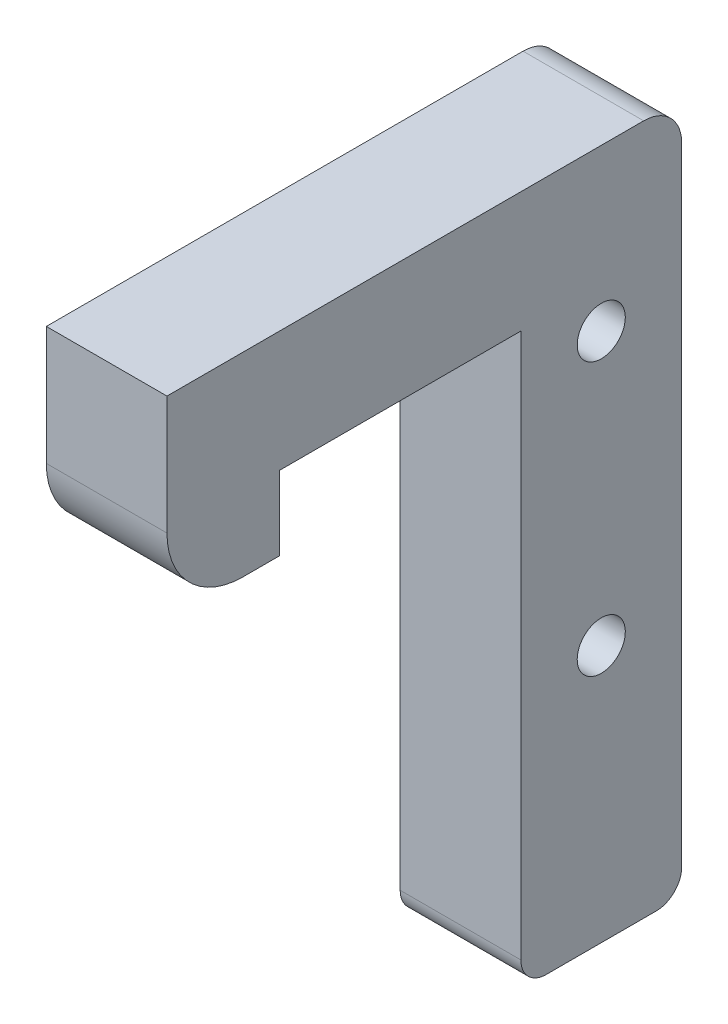
ISO-10303-21;
HEADER;
FILE_DESCRIPTION(('STEP AP214'),'2;1');
FILE_NAME('part.step','',(''),(''),'','','');
FILE_SCHEMA(('AUTOMOTIVE_DESIGN { 1 0 10303 214 1 1 1 1 }'));
ENDSEC;
DATA;
#1=APPLICATION_CONTEXT('core data for automotive mechanical design processes');
#2=APPLICATION_PROTOCOL_DEFINITION('international standard','automotive_design',2000,#1);
#3=PRODUCT_CONTEXT('',#1,'mechanical');
#4=PRODUCT('Part','Part','',(#3));
#5=PRODUCT_RELATED_PRODUCT_CATEGORY('part','',(#4));
#6=PRODUCT_DEFINITION_FORMATION('','',#4);
#7=PRODUCT_DEFINITION_CONTEXT('part definition',#1,'design');
#8=PRODUCT_DEFINITION('design','',#6,#7);
#9=PRODUCT_DEFINITION_SHAPE('','',#8);
#10=(LENGTH_UNIT() NAMED_UNIT(*) SI_UNIT(.MILLI.,.METRE.));
#11=(NAMED_UNIT(*) PLANE_ANGLE_UNIT() SI_UNIT($,.RADIAN.));
#12=(NAMED_UNIT(*) SI_UNIT($,.STERADIAN.) SOLID_ANGLE_UNIT());
#13=UNCERTAINTY_MEASURE_WITH_UNIT(LENGTH_MEASURE(1.E-05),#10,'distance_accuracy_value','');
#14=(GEOMETRIC_REPRESENTATION_CONTEXT(3) GLOBAL_UNCERTAINTY_ASSIGNED_CONTEXT((#13)) GLOBAL_UNIT_ASSIGNED_CONTEXT((#10,
#11,#12)) REPRESENTATION_CONTEXT('',''));
#15=CARTESIAN_POINT('',(0.,0.,0.));
#16=DIRECTION('',(0.,0.,1.));
#17=DIRECTION('',(1.,0.,0.));
#18=AXIS2_PLACEMENT_3D('',#15,#16,#17);
#19=CARTESIAN_POINT('',(-4.76249999999999,-45.,6.35));
#20=DIRECTION('',(0.,-1.,0.));
#21=DIRECTION('',(0.,0.,-1.));
#22=AXIS2_PLACEMENT_3D('',#19,#20,#21);
#23=CYLINDRICAL_SURFACE('',#22,1.89865);
#24=CARTESIAN_POINT('',(-4.76249999999999,-24.68,6.35));
#25=DIRECTION('',(0.707106781186547,-0.707106781186547,0.));
#26=DIRECTION('',(-0.707106781186547,-0.707106781186547,0.));
#27=AXIS2_PLACEMENT_3D('',#24,#25,#26);
#28=ELLIPSE('',#27,2.68509658019967,1.89864999999999);
#29=CARTESIAN_POINT('',(-4.76249999999999,-24.68,4.45135000000001));
#30=VERTEX_POINT('',#29);
#31=CARTESIAN_POINT('',(-4.76249999999999,-24.68,8.24864999999999));
#32=VERTEX_POINT('',#31);
#33=EDGE_CURVE('E132',#30,#32,#28,.T.);
#34=ORIENTED_EDGE('',*,*,#33,.T.);
#35=CARTESIAN_POINT('',(-4.76249999999999,-24.68,6.35));
#36=DIRECTION('',(-0.707106781186547,-0.707106781186547,0.));
#37=DIRECTION('',(0.707106781186547,-0.707106781186547,0.));
#38=AXIS2_PLACEMENT_3D('',#35,#36,#37);
#39=ELLIPSE('',#38,2.68509658019967,1.89864999999999);
#40=EDGE_CURVE('E139',#32,#30,#39,.T.);
#41=ORIENTED_EDGE('',*,*,#40,.T.);
#42=EDGE_LOOP('',(#34,#41));
#43=FACE_BOUND('',#42,.T.);
#44=CARTESIAN_POINT('',(-4.76249999999999,-20.108,6.35));
#45=DIRECTION('',(0.,-1.,0.));
#46=DIRECTION('',(0.,0.,-1.));
#47=AXIS2_PLACEMENT_3D('',#44,#45,#46);
#48=CIRCLE('',#47,1.89864999999999);
#49=CARTESIAN_POINT('',(-4.76249999999999,-20.108,4.45135000000001));
#50=VERTEX_POINT('',#49);
#51=EDGE_CURVE('E149',#50,#50,#48,.T.);
#52=ORIENTED_EDGE('',*,*,#51,.F.);
#53=EDGE_LOOP('',(#52));
#54=FACE_BOUND('',#53,.T.);
#55=ADVANCED_FACE('F33',(#43,#54),#23,.F.);
#56=CARTESIAN_POINT('',(-4.76249999999999,-20.108,6.35));
#57=DIRECTION('',(0.,-1.,0.));
#58=DIRECTION('',(0.,0.,-1.));
#59=AXIS2_PLACEMENT_3D('',#56,#57,#58);
#60=CONICAL_SURFACE('',#59,1.89864999999999,1.02974425867665);
#61=CARTESIAN_POINT('',(-4.76249999999999,-18.9671759856833,6.35));
#62=VERTEX_POINT('',#61);
#63=VERTEX_LOOP('',#62);
#64=FACE_BOUND('',#63,.T.);
#65=ORIENTED_EDGE('',*,*,#51,.T.);
#66=EDGE_LOOP('',(#65));
#67=FACE_BOUND('',#66,.T.);
#68=ADVANCED_FACE('F287',(#64,#67),#60,.F.);
#69=CARTESIAN_POINT('',(-9.52499999999999,-24.68,6.35));
#70=DIRECTION('',(-1.,0.,0.));
#71=DIRECTION('',(0.,0.,1.));
#72=AXIS2_PLACEMENT_3D('',#69,#70,#71);
#73=CYLINDRICAL_SURFACE('',#72,1.89864999999999);
#74=CARTESIAN_POINT('',(-9.52499999999999,-24.68,6.35));
#75=DIRECTION('',(-1.,0.,0.));
#76=DIRECTION('',(0.,0.,1.));
#77=AXIS2_PLACEMENT_3D('',#74,#75,#76);
#78=CIRCLE('',#77,1.89864999999999);
#79=CARTESIAN_POINT('',(-9.52499999999999,-24.68,8.24864999999999));
#80=VERTEX_POINT('',#79);
#81=EDGE_CURVE('E352',#80,#80,#78,.T.);
#82=ORIENTED_EDGE('',*,*,#81,.T.);
#83=EDGE_LOOP('',(#82));
#84=FACE_BOUND('',#83,.T.);
#85=CARTESIAN_POINT('',(-4.76249999999999,-24.68,6.35));
#86=DIRECTION('',(0.707106781186547,-0.707106781186547,0.));
#87=DIRECTION('',(-0.707106781186547,-0.707106781186547,0.));
#88=AXIS2_PLACEMENT_3D('',#85,#86,#87);
#89=ELLIPSE('',#88,2.68509658019967,1.89864999999999);
#90=EDGE_CURVE('E140',#30,#32,#89,.F.);
#91=ORIENTED_EDGE('',*,*,#90,.F.);
#92=ORIENTED_EDGE('',*,*,#40,.F.);
#93=EDGE_LOOP('',(#91,#92));
#94=FACE_BOUND('',#93,.T.);
#95=ADVANCED_FACE('F144',(#84,#94),#73,.F.);
#96=CARTESIAN_POINT('',(0.,-24.68,6.35));
#97=DIRECTION('',(-1.,0.,0.));
#98=DIRECTION('',(0.,-1.,0.));
#99=AXIS2_PLACEMENT_3D('',#96,#97,#98);
#100=CIRCLE('',#99,1.89864999999999);
#101=CARTESIAN_POINT('',(0.,-26.57865,6.35));
#102=VERTEX_POINT('',#101);
#103=EDGE_CURVE('E146',#102,#102,#100,.T.);
#104=ORIENTED_EDGE('',*,*,#103,.F.);
#105=EDGE_LOOP('',(#104));
#106=FACE_BOUND('',#105,.T.);
#107=ORIENTED_EDGE('',*,*,#33,.F.);
#108=CARTESIAN_POINT('',(-4.76249999999999,-24.68,6.35));
#109=DIRECTION('',(-0.707106781186547,-0.707106781186547,0.));
#110=DIRECTION('',(0.707106781186547,-0.707106781186547,0.));
#111=AXIS2_PLACEMENT_3D('',#108,#109,#110);
#112=ELLIPSE('',#111,2.68509658019967,1.89864999999999);
#113=EDGE_CURVE('E136',#32,#30,#112,.F.);
#114=ORIENTED_EDGE('',*,*,#113,.F.);
#115=EDGE_LOOP('',(#107,#114));
#116=FACE_BOUND('',#115,.T.);
#117=ADVANCED_FACE('F134',(#106,#116),#73,.F.);
#118=CARTESIAN_POINT('',(0.,0.,40.64));
#119=DIRECTION('',(0.,0.,1.));
#120=DIRECTION('',(1.,0.,0.));
#121=AXIS2_PLACEMENT_3D('',#118,#119,#120);
#122=PLANE('',#121);
#123=DIRECTION('',(0.,-1.,0.));
#124=VECTOR('',#123,1.);
#125=CARTESIAN_POINT('',(-9.525,0.,40.64));
#126=LINE('',#125,#124);
#127=CARTESIAN_POINT('',(-9.525,9.525,40.64));
#128=VERTEX_POINT('',#127);
#129=CARTESIAN_POINT('',(-9.525,0.157999999999998,40.64));
#130=VERTEX_POINT('',#129);
#131=EDGE_CURVE('E256',#128,#130,#126,.T.);
#132=ORIENTED_EDGE('',*,*,#131,.T.);
#133=DIRECTION('',(-1.,0.,0.));
#134=VECTOR('',#133,1.);
#135=CARTESIAN_POINT('',(0.,0.158,40.64));
#136=LINE('',#135,#134);
#137=CARTESIAN_POINT('',(0.,0.158,40.64));
#138=VERTEX_POINT('',#137);
#139=EDGE_CURVE('E208',#130,#138,#136,.F.);
#140=ORIENTED_EDGE('',*,*,#139,.T.);
#141=DIRECTION('',(0.,1.,0.));
#142=VECTOR('',#141,1.);
#143=CARTESIAN_POINT('',(0.,0.,40.64));
#144=LINE('',#143,#142);
#145=CARTESIAN_POINT('',(0.,9.525,40.64));
#146=VERTEX_POINT('',#145);
#147=EDGE_CURVE('E249',#138,#146,#144,.T.);
#148=ORIENTED_EDGE('',*,*,#147,.T.);
#149=DIRECTION('',(-1.,0.,0.));
#150=VECTOR('',#149,1.);
#151=CARTESIAN_POINT('',(0.,9.525,40.64));
#152=LINE('',#151,#150);
#153=EDGE_CURVE('E254',#146,#128,#152,.T.);
#154=ORIENTED_EDGE('',*,*,#153,.T.);
#155=EDGE_LOOP('',(#132,#140,#148,#154));
#156=FACE_BOUND('',#155,.T.);
#157=ADVANCED_FACE('F316',(#156),#122,.T.);
#158=CARTESIAN_POINT('',(-9.525,0.157999999999998,34.64));
#159=DIRECTION('',(-1.,0.,0.));
#160=DIRECTION('',(0.,-1.,0.));
#161=AXIS2_PLACEMENT_3D('',#158,#159,#160);
#162=CYLINDRICAL_SURFACE('',#161,6.);
#163=CARTESIAN_POINT('',(0.,0.158,34.64));
#164=DIRECTION('',(-1.,0.,0.));
#165=DIRECTION('',(0.,-1.,0.));
#166=AXIS2_PLACEMENT_3D('',#163,#164,#165);
#167=CIRCLE('',#166,6.);
#168=CARTESIAN_POINT('',(0.,-5.842,34.64));
#169=VERTEX_POINT('',#168);
#170=EDGE_CURVE('E210',#138,#169,#167,.F.);
#171=ORIENTED_EDGE('',*,*,#170,.F.);
#172=ORIENTED_EDGE('',*,*,#139,.F.);
#173=CARTESIAN_POINT('',(-9.525,0.157999999999998,34.64));
#174=DIRECTION('',(1.,0.,0.));
#175=DIRECTION('',(0.,0.,-1.));
#176=AXIS2_PLACEMENT_3D('',#173,#174,#175);
#177=CIRCLE('',#176,6.);
#178=CARTESIAN_POINT('',(-9.525,-5.842,34.64));
#179=VERTEX_POINT('',#178);
#180=EDGE_CURVE('E205',#179,#130,#177,.F.);
#181=ORIENTED_EDGE('',*,*,#180,.F.);
#182=DIRECTION('',(-1.,0.,0.));
#183=VECTOR('',#182,1.);
#184=CARTESIAN_POINT('',(-9.525,-5.842,34.64));
#185=LINE('',#184,#183);
#186=EDGE_CURVE('E202',#169,#179,#185,.T.);
#187=ORIENTED_EDGE('',*,*,#186,.F.);
#188=EDGE_LOOP('',(#171,#172,#181,#187));
#189=FACE_BOUND('',#188,.T.);
#190=ADVANCED_FACE('F312',(#189),#162,.T.);
#191=CARTESIAN_POINT('',(-9.525,-5.842,40.64));
#192=DIRECTION('',(0.,-1.,0.));
#193=DIRECTION('',(1.,0.,0.));
#194=AXIS2_PLACEMENT_3D('',#191,#192,#193);
#195=PLANE('',#194);
#196=DIRECTION('',(0.,0.,1.));
#197=VECTOR('',#196,1.);
#198=CARTESIAN_POINT('',(0.,-5.842,40.64));
#199=LINE('',#198,#197);
#200=CARTESIAN_POINT('',(0.,-5.842,31.75));
#201=VERTEX_POINT('',#200);
#202=EDGE_CURVE('E194',#201,#169,#199,.T.);
#203=ORIENTED_EDGE('',*,*,#202,.T.);
#204=ORIENTED_EDGE('',*,*,#186,.T.);
#205=DIRECTION('',(0.,0.,-1.));
#206=VECTOR('',#205,1.);
#207=CARTESIAN_POINT('',(-9.525,-5.842,40.64));
#208=LINE('',#207,#206);
#209=CARTESIAN_POINT('',(-9.525,-5.842,31.75));
#210=VERTEX_POINT('',#209);
#211=EDGE_CURVE('E181',#179,#210,#208,.T.);
#212=ORIENTED_EDGE('',*,*,#211,.T.);
#213=DIRECTION('',(1.,0.,0.));
#214=VECTOR('',#213,1.);
#215=CARTESIAN_POINT('',(-9.525,-5.842,31.75));
#216=LINE('',#215,#214);
#217=EDGE_CURVE('E502',#210,#201,#216,.T.);
#218=ORIENTED_EDGE('',*,*,#217,.T.);
#219=EDGE_LOOP('',(#203,#204,#212,#218));
#220=FACE_BOUND('',#219,.T.);
#221=ADVANCED_FACE('F315',(#220),#195,.T.);
#222=CARTESIAN_POINT('',(-9.525,-5.842,31.75));
#223=DIRECTION('',(0.,0.,1.));
#224=DIRECTION('',(1.,0.,0.));
#225=AXIS2_PLACEMENT_3D('',#222,#223,#224);
#226=PLANE('',#225);
#227=DIRECTION('',(1.,0.,0.));
#228=VECTOR('',#227,1.);
#229=CARTESIAN_POINT('',(-9.525,0.,31.75));
#230=LINE('',#229,#228);
#231=CARTESIAN_POINT('',(-9.525,0.,31.75));
#232=VERTEX_POINT('',#231);
#233=CARTESIAN_POINT('',(0.,0.,31.75));
#234=VERTEX_POINT('',#233);
#235=EDGE_CURVE('E178',#232,#234,#230,.T.);
#236=ORIENTED_EDGE('',*,*,#235,.T.);
#237=DIRECTION('',(0.,1.,0.));
#238=VECTOR('',#237,1.);
#239=CARTESIAN_POINT('',(0.,-5.842,31.75));
#240=LINE('',#239,#238);
#241=EDGE_CURVE('E190',#201,#234,#240,.T.);
#242=ORIENTED_EDGE('',*,*,#241,.F.);
#243=ORIENTED_EDGE('',*,*,#217,.F.);
#244=DIRECTION('',(0.,1.,0.));
#245=VECTOR('',#244,1.);
#246=CARTESIAN_POINT('',(-9.525,-5.842,31.75));
#247=LINE('',#246,#245);
#248=EDGE_CURVE('E193',#210,#232,#247,.T.);
#249=ORIENTED_EDGE('',*,*,#248,.T.);
#250=EDGE_LOOP('',(#236,#242,#243,#249));
#251=FACE_BOUND('',#250,.T.);
#252=ADVANCED_FACE('F308',(#251),#226,.F.);
#253=CARTESIAN_POINT('',(0.,0.,40.64));
#254=DIRECTION('',(0.,1.,0.));
#255=DIRECTION('',(-1.,0.,0.));
#256=AXIS2_PLACEMENT_3D('',#253,#254,#255);
#257=PLANE('',#256);
#258=DIRECTION('',(-1.,0.,0.));
#259=VECTOR('',#258,1.);
#260=CARTESIAN_POINT('',(0.,0.,12.7));
#261=LINE('',#260,#259);
#262=CARTESIAN_POINT('',(0.,0.,12.7));
#263=VERTEX_POINT('',#262);
#264=CARTESIAN_POINT('',(-9.525,0.,12.7));
#265=VERTEX_POINT('',#264);
#266=EDGE_CURVE('E165',#263,#265,#261,.T.);
#267=ORIENTED_EDGE('',*,*,#266,.F.);
#268=DIRECTION('',(0.,0.,-1.));
#269=VECTOR('',#268,1.);
#270=CARTESIAN_POINT('',(0.,0.,40.64));
#271=LINE('',#270,#269);
#272=EDGE_CURVE('E259',#234,#263,#271,.T.);
#273=ORIENTED_EDGE('',*,*,#272,.F.);
#274=ORIENTED_EDGE('',*,*,#235,.F.);
#275=DIRECTION('',(0.,0.,-1.));
#276=VECTOR('',#275,1.);
#277=CARTESIAN_POINT('',(-9.525,0.,40.64));
#278=LINE('',#277,#276);
#279=EDGE_CURVE('E187',#232,#265,#278,.T.);
#280=ORIENTED_EDGE('',*,*,#279,.T.);
#281=EDGE_LOOP('',(#267,#273,#274,#280));
#282=FACE_BOUND('',#281,.T.);
#283=ADVANCED_FACE('F274',(#282),#257,.F.);
#284=CARTESIAN_POINT('',(0.,-45.,12.7));
#285=DIRECTION('',(0.,0.,-1.));
#286=DIRECTION('',(-1.,0.,0.));
#287=AXIS2_PLACEMENT_3D('',#284,#285,#286);
#288=PLANE('',#287);
#289=DIRECTION('',(0.,1.,0.));
#290=VECTOR('',#289,1.);
#291=CARTESIAN_POINT('',(-9.52499999999999,-45.,12.7));
#292=LINE('',#291,#290);
#293=CARTESIAN_POINT('',(-9.52499999999999,-43.,12.7));
#294=VERTEX_POINT('',#293);
#295=EDGE_CURVE('E174',#294,#265,#292,.T.);
#296=ORIENTED_EDGE('',*,*,#295,.F.);
#297=DIRECTION('',(-1.,0.,0.));
#298=VECTOR('',#297,1.);
#299=CARTESIAN_POINT('',(0.,-43.,12.7));
#300=LINE('',#299,#298);
#301=CARTESIAN_POINT('',(0.,-43.,12.7));
#302=VERTEX_POINT('',#301);
#303=EDGE_CURVE('E11',#294,#302,#300,.F.);
#304=ORIENTED_EDGE('',*,*,#303,.T.);
#305=DIRECTION('',(0.,1.,0.));
#306=VECTOR('',#305,1.);
#307=CARTESIAN_POINT('',(0.,-45.,12.7));
#308=LINE('',#307,#306);
#309=EDGE_CURVE('E176',#302,#263,#308,.T.);
#310=ORIENTED_EDGE('',*,*,#309,.T.);
#311=ORIENTED_EDGE('',*,*,#266,.T.);
#312=EDGE_LOOP('',(#296,#304,#310,#311));
#313=FACE_BOUND('',#312,.T.);
#314=ADVANCED_FACE('F277',(#313),#288,.F.);
#315=CARTESIAN_POINT('',(-4.76249999999999,-45.,6.35));
#316=DIRECTION('',(0.,-1.,0.));
#317=DIRECTION('',(0.,0.,-1.));
#318=AXIS2_PLACEMENT_3D('',#315,#316,#317);
#319=CIRCLE('',#318,1.89865);
#320=CARTESIAN_POINT('',(-4.76249999999999,-45.,4.45135));
#321=VERTEX_POINT('',#320);
#322=EDGE_CURVE('E156',#321,#321,#319,.T.);
#323=ORIENTED_EDGE('',*,*,#322,.T.);
#324=EDGE_LOOP('',(#323));
#325=FACE_BOUND('',#324,.T.);
#326=ORIENTED_EDGE('',*,*,#90,.T.);
#327=ORIENTED_EDGE('',*,*,#113,.T.);
#328=EDGE_LOOP('',(#326,#327));
#329=FACE_BOUND('',#328,.T.);
#330=ADVANCED_FACE('F148',(#325,#329),#23,.F.);
#331=CARTESIAN_POINT('',(0.,-45.,0.));
#332=DIRECTION('',(0.,-1.,0.));
#333=DIRECTION('',(1.,0.,0.));
#334=AXIS2_PLACEMENT_3D('',#331,#332,#333);
#335=PLANE('',#334);
#336=ORIENTED_EDGE('',*,*,#322,.F.);
#337=EDGE_LOOP('',(#336));
#338=FACE_BOUND('',#337,.T.);
#339=DIRECTION('',(0.,0.,-1.));
#340=VECTOR('',#339,1.);
#341=CARTESIAN_POINT('',(-9.52499999999999,-45.,0.));
#342=LINE('',#341,#340);
#343=CARTESIAN_POINT('',(-9.52499999999999,-45.,10.7));
#344=VERTEX_POINT('',#343);
#345=CARTESIAN_POINT('',(-9.52499999999999,-45.,2.));
#346=VERTEX_POINT('',#345);
#347=EDGE_CURVE('E171',#344,#346,#342,.T.);
#348=ORIENTED_EDGE('',*,*,#347,.T.);
#349=DIRECTION('',(1.,0.,0.));
#350=VECTOR('',#349,1.);
#351=CARTESIAN_POINT('',(0.,-45.,2.));
#352=LINE('',#351,#350);
#353=CARTESIAN_POINT('',(0.,-45.,2.));
#354=VERTEX_POINT('',#353);
#355=EDGE_CURVE('E225',#346,#354,#352,.T.);
#356=ORIENTED_EDGE('',*,*,#355,.T.);
#357=DIRECTION('',(0.,0.,1.));
#358=VECTOR('',#357,1.);
#359=CARTESIAN_POINT('',(0.,-45.,0.));
#360=LINE('',#359,#358);
#361=CARTESIAN_POINT('',(0.,-45.,10.7));
#362=VERTEX_POINT('',#361);
#363=EDGE_CURVE('E168',#354,#362,#360,.T.);
#364=ORIENTED_EDGE('',*,*,#363,.T.);
#365=DIRECTION('',(-1.,0.,0.));
#366=VECTOR('',#365,1.);
#367=CARTESIAN_POINT('',(-9.52499999999999,-45.,10.7));
#368=LINE('',#367,#366);
#369=EDGE_CURVE('E222',#362,#344,#368,.T.);
#370=ORIENTED_EDGE('',*,*,#369,.T.);
#371=EDGE_LOOP('',(#348,#356,#364,#370));
#372=FACE_BOUND('',#371,.T.);
#373=ADVANCED_FACE('F239',(#338,#372),#335,.T.);
#374=CARTESIAN_POINT('',(0.,0.,0.));
#375=DIRECTION('',(0.,0.,1.));
#376=DIRECTION('',(1.,0.,0.));
#377=AXIS2_PLACEMENT_3D('',#374,#375,#376);
#378=PLANE('',#377);
#379=DIRECTION('',(0.,1.,0.));
#380=VECTOR('',#379,1.);
#381=CARTESIAN_POINT('',(0.,0.,0.));
#382=LINE('',#381,#380);
#383=CARTESIAN_POINT('',(0.,-43.,0.));
#384=VERTEX_POINT('',#383);
#385=CARTESIAN_POINT('',(0.,6.525,0.));
#386=VERTEX_POINT('',#385);
#387=EDGE_CURVE('E199',#384,#386,#382,.T.);
#388=ORIENTED_EDGE('',*,*,#387,.F.);
#389=DIRECTION('',(1.,0.,0.));
#390=VECTOR('',#389,1.);
#391=CARTESIAN_POINT('',(-9.52499999999999,-43.,0.));
#392=LINE('',#391,#390);
#393=CARTESIAN_POINT('',(-9.525,-43.,0.));
#394=VERTEX_POINT('',#393);
#395=EDGE_CURVE('E56',#384,#394,#392,.F.);
#396=ORIENTED_EDGE('',*,*,#395,.T.);
#397=DIRECTION('',(0.,-1.,0.));
#398=VECTOR('',#397,1.);
#399=CARTESIAN_POINT('',(-9.525,0.,0.));
#400=LINE('',#399,#398);
#401=CARTESIAN_POINT('',(-9.525,6.525,0.));
#402=VERTEX_POINT('',#401);
#403=EDGE_CURVE('E235',#402,#394,#400,.T.);
#404=ORIENTED_EDGE('',*,*,#403,.F.);
#405=DIRECTION('',(-1.,0.,0.));
#406=VECTOR('',#405,1.);
#407=CARTESIAN_POINT('',(0.,6.525,0.));
#408=LINE('',#407,#406);
#409=EDGE_CURVE('E217',#402,#386,#408,.F.);
#410=ORIENTED_EDGE('',*,*,#409,.T.);
#411=EDGE_LOOP('',(#388,#396,#404,#410));
#412=FACE_BOUND('',#411,.T.);
#413=ADVANCED_FACE('F245',(#412),#378,.F.);
#414=CARTESIAN_POINT('',(0.,6.525,3.));
#415=DIRECTION('',(-1.,0.,0.));
#416=DIRECTION('',(0.,-1.,0.));
#417=AXIS2_PLACEMENT_3D('',#414,#415,#416);
#418=CYLINDRICAL_SURFACE('',#417,3.);
#419=CARTESIAN_POINT('',(0.,6.525,3.));
#420=DIRECTION('',(-1.,0.,0.));
#421=DIRECTION('',(0.,-1.,0.));
#422=AXIS2_PLACEMENT_3D('',#419,#420,#421);
#423=CIRCLE('',#422,3.);
#424=CARTESIAN_POINT('',(0.,9.525,3.));
#425=VERTEX_POINT('',#424);
#426=EDGE_CURVE('E220',#386,#425,#423,.F.);
#427=ORIENTED_EDGE('',*,*,#426,.F.);
#428=ORIENTED_EDGE('',*,*,#409,.F.);
#429=CARTESIAN_POINT('',(-9.525,6.525,3.));
#430=DIRECTION('',(1.,0.,0.));
#431=DIRECTION('',(0.,0.,-1.));
#432=AXIS2_PLACEMENT_3D('',#429,#430,#431);
#433=CIRCLE('',#432,3.);
#434=CARTESIAN_POINT('',(-9.525,9.525,3.));
#435=VERTEX_POINT('',#434);
#436=EDGE_CURVE('E215',#435,#402,#433,.F.);
#437=ORIENTED_EDGE('',*,*,#436,.F.);
#438=DIRECTION('',(-1.,0.,0.));
#439=VECTOR('',#438,1.);
#440=CARTESIAN_POINT('',(0.,9.525,3.));
#441=LINE('',#440,#439);
#442=EDGE_CURVE('E212',#425,#435,#441,.T.);
#443=ORIENTED_EDGE('',*,*,#442,.F.);
#444=EDGE_LOOP('',(#427,#428,#437,#443));
#445=FACE_BOUND('',#444,.T.);
#446=ADVANCED_FACE('F326',(#445),#418,.T.);
#447=CARTESIAN_POINT('',(0.,9.525,40.64));
#448=DIRECTION('',(0.,-1.,0.));
#449=DIRECTION('',(1.,0.,0.));
#450=AXIS2_PLACEMENT_3D('',#447,#448,#449);
#451=PLANE('',#450);
#452=DIRECTION('',(0.,0.,-1.));
#453=VECTOR('',#452,1.);
#454=CARTESIAN_POINT('',(0.,9.525,40.64));
#455=LINE('',#454,#453);
#456=EDGE_CURVE('E206',#146,#425,#455,.T.);
#457=ORIENTED_EDGE('',*,*,#456,.T.);
#458=ORIENTED_EDGE('',*,*,#442,.T.);
#459=DIRECTION('',(0.,0.,-1.));
#460=VECTOR('',#459,1.);
#461=CARTESIAN_POINT('',(-9.525,9.525,40.64));
#462=LINE('',#461,#460);
#463=EDGE_CURVE('E266',#128,#435,#462,.T.);
#464=ORIENTED_EDGE('',*,*,#463,.F.);
#465=ORIENTED_EDGE('',*,*,#153,.F.);
#466=EDGE_LOOP('',(#457,#458,#464,#465));
#467=FACE_BOUND('',#466,.T.);
#468=ADVANCED_FACE('F334',(#467),#451,.F.);
#469=CARTESIAN_POINT('',(0.,0.,40.64));
#470=DIRECTION('',(-1.,0.,0.));
#471=DIRECTION('',(0.,-1.,0.));
#472=AXIS2_PLACEMENT_3D('',#469,#470,#471);
#473=PLANE('',#472);
#474=ORIENTED_EDGE('',*,*,#103,.T.);
#475=EDGE_LOOP('',(#474));
#476=FACE_BOUND('',#475,.T.);
#477=CARTESIAN_POINT('',(0.,-3.175,6.35));
#478=DIRECTION('',(1.,0.,0.));
#479=DIRECTION('',(0.,0.,-1.));
#480=AXIS2_PLACEMENT_3D('',#477,#478,#479);
#481=CIRCLE('',#480,1.89865);
#482=CARTESIAN_POINT('',(0.,-3.175,4.45135));
#483=VERTEX_POINT('',#482);
#484=EDGE_CURVE('E159',#483,#483,#481,.T.);
#485=ORIENTED_EDGE('',*,*,#484,.F.);
#486=EDGE_LOOP('',(#485));
#487=FACE_BOUND('',#486,.T.);
#488=ORIENTED_EDGE('',*,*,#363,.F.);
#489=CARTESIAN_POINT('',(0.,-43.,2.));
#490=DIRECTION('',(-1.,0.,0.));
#491=DIRECTION('',(0.,-1.,0.));
#492=AXIS2_PLACEMENT_3D('',#489,#490,#491);
#493=CIRCLE('',#492,2.);
#494=EDGE_CURVE('E230',#354,#384,#493,.F.);
#495=ORIENTED_EDGE('',*,*,#494,.T.);
#496=ORIENTED_EDGE('',*,*,#387,.T.);
#497=ORIENTED_EDGE('',*,*,#426,.T.);
#498=ORIENTED_EDGE('',*,*,#456,.F.);
#499=ORIENTED_EDGE('',*,*,#147,.F.);
#500=ORIENTED_EDGE('',*,*,#170,.T.);
#501=ORIENTED_EDGE('',*,*,#202,.F.);
#502=ORIENTED_EDGE('',*,*,#241,.T.);
#503=ORIENTED_EDGE('',*,*,#272,.T.);
#504=ORIENTED_EDGE('',*,*,#309,.F.);
#505=CARTESIAN_POINT('',(0.,-43.,10.7));
#506=DIRECTION('',(-1.,0.,0.));
#507=DIRECTION('',(0.,-1.,0.));
#508=AXIS2_PLACEMENT_3D('',#505,#506,#507);
#509=CIRCLE('',#508,2.);
#510=EDGE_CURVE('E228',#302,#362,#509,.F.);
#511=ORIENTED_EDGE('',*,*,#510,.T.);
#512=EDGE_LOOP('',(#488,#495,#496,#497,#498,#499,#500,#501,#502,#503,#504,#511));
#513=FACE_BOUND('',#512,.T.);
#514=ADVANCED_FACE('F244',(#476,#487,#513),#473,.F.);
#515=CARTESIAN_POINT('',(0.,-3.175,6.35));
#516=DIRECTION('',(1.,0.,0.));
#517=DIRECTION('',(0.,0.,-1.));
#518=AXIS2_PLACEMENT_3D('',#515,#516,#517);
#519=CYLINDRICAL_SURFACE('',#518,1.89865);
#520=ORIENTED_EDGE('',*,*,#484,.T.);
#521=EDGE_LOOP('',(#520));
#522=FACE_BOUND('',#521,.T.);
#523=CARTESIAN_POINT('',(-9.525,-3.175,6.35));
#524=DIRECTION('',(1.,0.,0.));
#525=DIRECTION('',(0.,0.,-1.));
#526=AXIS2_PLACEMENT_3D('',#523,#524,#525);
#527=CIRCLE('',#526,1.89865);
#528=CARTESIAN_POINT('',(-9.525,-3.175,4.45135));
#529=VERTEX_POINT('',#528);
#530=EDGE_CURVE('E162',#529,#529,#527,.T.);
#531=ORIENTED_EDGE('',*,*,#530,.F.);
#532=EDGE_LOOP('',(#531));
#533=FACE_BOUND('',#532,.T.);
#534=ADVANCED_FACE('F332',(#522,#533),#519,.F.);
#535=CARTESIAN_POINT('',(-9.525,0.,40.64));
#536=DIRECTION('',(1.,0.,0.));
#537=DIRECTION('',(0.,0.,-1.));
#538=AXIS2_PLACEMENT_3D('',#535,#536,#537);
#539=PLANE('',#538);
#540=ORIENTED_EDGE('',*,*,#81,.F.);
#541=EDGE_LOOP('',(#540));
#542=FACE_BOUND('',#541,.T.);
#543=ORIENTED_EDGE('',*,*,#530,.T.);
#544=EDGE_LOOP('',(#543));
#545=FACE_BOUND('',#544,.T.);
#546=ORIENTED_EDGE('',*,*,#403,.T.);
#547=CARTESIAN_POINT('',(-9.525,-43.,2.));
#548=DIRECTION('',(1.,0.,0.));
#549=DIRECTION('',(0.,0.,-1.));
#550=AXIS2_PLACEMENT_3D('',#547,#548,#549);
#551=CIRCLE('',#550,2.);
#552=EDGE_CURVE('E41',#394,#346,#551,.F.);
#553=ORIENTED_EDGE('',*,*,#552,.T.);
#554=ORIENTED_EDGE('',*,*,#347,.F.);
#555=CARTESIAN_POINT('',(-9.525,-43.,10.7));
#556=DIRECTION('',(1.,0.,0.));
#557=DIRECTION('',(0.,0.,-1.));
#558=AXIS2_PLACEMENT_3D('',#555,#556,#557);
#559=CIRCLE('',#558,2.);
#560=EDGE_CURVE('E48',#344,#294,#559,.F.);
#561=ORIENTED_EDGE('',*,*,#560,.T.);
#562=ORIENTED_EDGE('',*,*,#295,.T.);
#563=ORIENTED_EDGE('',*,*,#279,.F.);
#564=ORIENTED_EDGE('',*,*,#248,.F.);
#565=ORIENTED_EDGE('',*,*,#211,.F.);
#566=ORIENTED_EDGE('',*,*,#180,.T.);
#567=ORIENTED_EDGE('',*,*,#131,.F.);
#568=ORIENTED_EDGE('',*,*,#463,.T.);
#569=ORIENTED_EDGE('',*,*,#436,.T.);
#570=EDGE_LOOP('',(#546,#553,#554,#561,#562,#563,#564,#565,#566,#567,#568,#569));
#571=FACE_BOUND('',#570,.T.);
#572=ADVANCED_FACE('F234',(#542,#545,#571),#539,.F.);
#573=CARTESIAN_POINT('',(0.,-43.,2.));
#574=DIRECTION('',(-1.,0.,0.));
#575=DIRECTION('',(0.,-1.,0.));
#576=AXIS2_PLACEMENT_3D('',#573,#574,#575);
#577=CYLINDRICAL_SURFACE('',#576,2.);
#578=ORIENTED_EDGE('',*,*,#552,.F.);
#579=ORIENTED_EDGE('',*,*,#395,.F.);
#580=ORIENTED_EDGE('',*,*,#494,.F.);
#581=ORIENTED_EDGE('',*,*,#355,.F.);
#582=EDGE_LOOP('',(#578,#579,#580,#581));
#583=FACE_BOUND('',#582,.T.);
#584=ADVANCED_FACE('F242',(#583),#577,.T.);
#585=CARTESIAN_POINT('',(0.,-43.,10.7));
#586=DIRECTION('',(1.,0.,0.));
#587=DIRECTION('',(0.,1.,0.));
#588=AXIS2_PLACEMENT_3D('',#585,#586,#587);
#589=CYLINDRICAL_SURFACE('',#588,2.);
#590=ORIENTED_EDGE('',*,*,#510,.F.);
#591=ORIENTED_EDGE('',*,*,#303,.F.);
#592=ORIENTED_EDGE('',*,*,#560,.F.);
#593=ORIENTED_EDGE('',*,*,#369,.F.);
#594=EDGE_LOOP('',(#590,#591,#592,#593));
#595=FACE_BOUND('',#594,.T.);
#596=ADVANCED_FACE('F35',(#595),#589,.T.);
#597=CLOSED_SHELL('',(#55,#68,#95,#117,#157,#190,#221,#252,#283,#314,#330,#373,#413,#446,#468,
#514,#534,#572,#584,#596));
#598=MANIFOLD_SOLID_BREP('B2',#597);
#599=ADVANCED_BREP_SHAPE_REPRESENTATION('',(#18,#598),#14);
#600=SHAPE_DEFINITION_REPRESENTATION(#9,#599);
ENDSEC;
END-ISO-10303-21;
